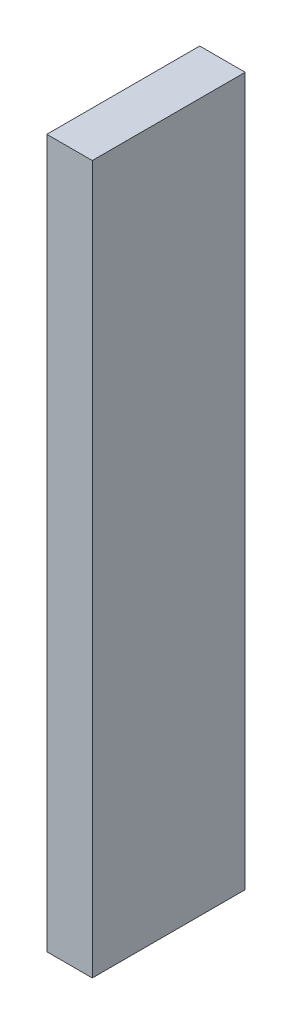
ISO-10303-21;
HEADER;
FILE_DESCRIPTION(('STEP AP214'),'2;1');
FILE_NAME('part.step','',(''),(''),'','','');
FILE_SCHEMA(('AUTOMOTIVE_DESIGN { 1 0 10303 214 1 1 1 1 }'));
ENDSEC;
DATA;
#1=APPLICATION_CONTEXT('core data for automotive mechanical design processes');
#2=APPLICATION_PROTOCOL_DEFINITION('international standard','automotive_design',2000,#1);
#3=PRODUCT_CONTEXT('',#1,'mechanical');
#4=PRODUCT('Part','Part','',(#3));
#5=PRODUCT_RELATED_PRODUCT_CATEGORY('part','',(#4));
#6=PRODUCT_DEFINITION_FORMATION('','',#4);
#7=PRODUCT_DEFINITION_CONTEXT('part definition',#1,'design');
#8=PRODUCT_DEFINITION('design','',#6,#7);
#9=PRODUCT_DEFINITION_SHAPE('','',#8);
#10=(LENGTH_UNIT() NAMED_UNIT(*) SI_UNIT(.MILLI.,.METRE.));
#11=(NAMED_UNIT(*) PLANE_ANGLE_UNIT() SI_UNIT($,.RADIAN.));
#12=(NAMED_UNIT(*) SI_UNIT($,.STERADIAN.) SOLID_ANGLE_UNIT());
#13=UNCERTAINTY_MEASURE_WITH_UNIT(LENGTH_MEASURE(1.E-05),#10,'distance_accuracy_value','');
#14=(GEOMETRIC_REPRESENTATION_CONTEXT(3) GLOBAL_UNCERTAINTY_ASSIGNED_CONTEXT((#13)) GLOBAL_UNIT_ASSIGNED_CONTEXT((#10,
#11,#12)) REPRESENTATION_CONTEXT('',''));
#15=CARTESIAN_POINT('',(0.,0.,0.));
#16=DIRECTION('',(0.,0.,1.));
#17=DIRECTION('',(1.,0.,0.));
#18=AXIS2_PLACEMENT_3D('',#15,#16,#17);
#19=CARTESIAN_POINT('',(130.275545153243,22.4180708263693,121.072024477607));
#20=DIRECTION('',(-1.69244514382854E-09,0.,1.));
#21=DIRECTION('',(1.,0.,1.69244514382854E-09));
#22=AXIS2_PLACEMENT_3D('',#19,#20,#21);
#23=PLANE('',#22);
#24=DIRECTION('',(0.,-1.,0.));
#25=VECTOR('',#24,1.);
#26=CARTESIAN_POINT('',(131.258630250256,22.4180708263693,121.07202447927));
#27=LINE('',#26,#25);
#28=CARTESIAN_POINT('',(131.258630250256,22.4180708263693,121.07202447927));
#29=VERTEX_POINT('',#28);
#30=CARTESIAN_POINT('',(131.258630250256,7.11212965552235,121.07202447927));
#31=VERTEX_POINT('',#30);
#32=EDGE_CURVE('E79',#29,#31,#27,.T.);
#33=ORIENTED_EDGE('',*,*,#32,.F.);
#34=DIRECTION('',(1.,0.,1.69244514382854E-09));
#35=VECTOR('',#34,1.);
#36=CARTESIAN_POINT('',(130.275545153243,22.4180708263693,121.072024477607));
#37=LINE('',#36,#35);
#38=CARTESIAN_POINT('',(130.275545153243,22.4180708263693,121.072024477607));
#39=VERTEX_POINT('',#38);
#40=EDGE_CURVE('E32',#39,#29,#37,.T.);
#41=ORIENTED_EDGE('',*,*,#40,.F.);
#42=DIRECTION('',(0.,-1.,0.));
#43=VECTOR('',#42,1.);
#44=CARTESIAN_POINT('',(130.275545153243,22.4180708263693,121.072024477607));
#45=LINE('',#44,#43);
#46=CARTESIAN_POINT('',(130.275545153243,7.11212965552235,121.072024477607));
#47=VERTEX_POINT('',#46);
#48=EDGE_CURVE('E71',#39,#47,#45,.T.);
#49=ORIENTED_EDGE('',*,*,#48,.T.);
#50=DIRECTION('',(1.,0.,1.69244514382854E-09));
#51=VECTOR('',#50,1.);
#52=CARTESIAN_POINT('',(130.275545153243,7.11212965552235,121.072024477607));
#53=LINE('',#52,#51);
#54=EDGE_CURVE('E10',#47,#31,#53,.T.);
#55=ORIENTED_EDGE('',*,*,#54,.T.);
#56=EDGE_LOOP('',(#33,#41,#49,#55));
#57=FACE_BOUND('',#56,.T.);
#58=ADVANCED_FACE('F16',(#57),#23,.T.);
#59=CARTESIAN_POINT('',(130.275545153243,7.11212965552235,121.072024477607));
#60=DIRECTION('',(0.,-1.,0.));
#61=DIRECTION('',(0.,0.,-1.));
#62=AXIS2_PLACEMENT_3D('',#59,#60,#61);
#63=PLANE('',#62);
#64=DIRECTION('',(1.69244514382854E-09,0.,-1.));
#65=VECTOR('',#64,1.);
#66=CARTESIAN_POINT('',(131.258630250256,7.11212965552235,121.07202447927));
#67=LINE('',#66,#65);
#68=CARTESIAN_POINT('',(131.258630255852,7.11212965552235,117.766083308422));
#69=VERTEX_POINT('',#68);
#70=EDGE_CURVE('E82',#31,#69,#67,.T.);
#71=ORIENTED_EDGE('',*,*,#70,.F.);
#72=ORIENTED_EDGE('',*,*,#54,.F.);
#73=DIRECTION('',(1.69244514382854E-09,0.,-1.));
#74=VECTOR('',#73,1.);
#75=CARTESIAN_POINT('',(130.275545153243,7.11212965552235,121.072024477607));
#76=LINE('',#75,#74);
#77=CARTESIAN_POINT('',(130.275545158838,7.11212965552235,117.766083306758));
#78=VERTEX_POINT('',#77);
#79=EDGE_CURVE('E67',#47,#78,#76,.T.);
#80=ORIENTED_EDGE('',*,*,#79,.T.);
#81=DIRECTION('',(1.,0.,1.69244514382854E-09));
#82=VECTOR('',#81,1.);
#83=CARTESIAN_POINT('',(130.275545158838,7.11212965552235,117.766083306758));
#84=LINE('',#83,#82);
#85=EDGE_CURVE('E24',#78,#69,#84,.T.);
#86=ORIENTED_EDGE('',*,*,#85,.T.);
#87=EDGE_LOOP('',(#71,#72,#80,#86));
#88=FACE_BOUND('',#87,.T.);
#89=ADVANCED_FACE('F68',(#88),#63,.T.);
#90=CARTESIAN_POINT('',(130.275545158838,7.11212965552235,117.766083306758));
#91=DIRECTION('',(1.69244514382854E-09,0.,-1.));
#92=DIRECTION('',(-1.,0.,-1.69244514382854E-09));
#93=AXIS2_PLACEMENT_3D('',#90,#91,#92);
#94=PLANE('',#93);
#95=DIRECTION('',(0.,1.,0.));
#96=VECTOR('',#95,1.);
#97=CARTESIAN_POINT('',(131.258630255852,7.11212965552235,117.766083308422));
#98=LINE('',#97,#96);
#99=CARTESIAN_POINT('',(131.258630255852,22.418070826371,117.766083299961));
#100=VERTEX_POINT('',#99);
#101=EDGE_CURVE('E65',#69,#100,#98,.T.);
#102=ORIENTED_EDGE('',*,*,#101,.F.);
#103=ORIENTED_EDGE('',*,*,#85,.F.);
#104=DIRECTION('',(0.,1.,0.));
#105=VECTOR('',#104,1.);
#106=CARTESIAN_POINT('',(130.275545158838,7.11212965552235,117.766083306758));
#107=LINE('',#106,#105);
#108=CARTESIAN_POINT('',(130.275545158838,22.418070826371,117.766083298297));
#109=VERTEX_POINT('',#108);
#110=EDGE_CURVE('E62',#78,#109,#107,.T.);
#111=ORIENTED_EDGE('',*,*,#110,.T.);
#112=DIRECTION('',(1.,0.,1.69244514382854E-09));
#113=VECTOR('',#112,1.);
#114=CARTESIAN_POINT('',(130.275545158838,22.418070826371,117.766083298297));
#115=LINE('',#114,#113);
#116=EDGE_CURVE('E48',#109,#100,#115,.T.);
#117=ORIENTED_EDGE('',*,*,#116,.T.);
#118=EDGE_LOOP('',(#102,#103,#111,#117));
#119=FACE_BOUND('',#118,.T.);
#120=ADVANCED_FACE('F60',(#119),#94,.T.);
#121=CARTESIAN_POINT('',(130.275545158838,22.418070826371,117.766083298297));
#122=DIRECTION('',(0.,1.,0.));
#123=DIRECTION('',(-1.,0.,0.));
#124=AXIS2_PLACEMENT_3D('',#121,#122,#123);
#125=PLANE('',#124);
#126=DIRECTION('',(-1.69244514382854E-09,0.,1.));
#127=VECTOR('',#126,1.);
#128=CARTESIAN_POINT('',(131.258630255852,22.418070826371,117.766083299961));
#129=LINE('',#128,#127);
#130=EDGE_CURVE('E85',#100,#29,#129,.T.);
#131=ORIENTED_EDGE('',*,*,#130,.F.);
#132=ORIENTED_EDGE('',*,*,#116,.F.);
#133=DIRECTION('',(-1.69244514382854E-09,0.,1.));
#134=VECTOR('',#133,1.);
#135=CARTESIAN_POINT('',(130.275545158838,22.418070826371,117.766083298297));
#136=LINE('',#135,#134);
#137=EDGE_CURVE('E74',#109,#39,#136,.T.);
#138=ORIENTED_EDGE('',*,*,#137,.T.);
#139=ORIENTED_EDGE('',*,*,#40,.T.);
#140=EDGE_LOOP('',(#131,#132,#138,#139));
#141=FACE_BOUND('',#140,.T.);
#142=ADVANCED_FACE('F96',(#141),#125,.T.);
#143=CARTESIAN_POINT('',(130.275545201028,17.2651002409467,92.8378607087388));
#144=DIRECTION('',(1.,0.,1.69244514382854E-09));
#145=DIRECTION('',(0.,1.,0.));
#146=AXIS2_PLACEMENT_3D('',#143,#144,#145);
#147=PLANE('',#146);
#148=ORIENTED_EDGE('',*,*,#48,.F.);
#149=ORIENTED_EDGE('',*,*,#137,.F.);
#150=ORIENTED_EDGE('',*,*,#110,.F.);
#151=ORIENTED_EDGE('',*,*,#79,.F.);
#152=EDGE_LOOP('',(#148,#149,#150,#151));
#153=FACE_BOUND('',#152,.T.);
#154=ADVANCED_FACE('F73',(#153),#147,.F.);
#155=CARTESIAN_POINT('',(131.258630298041,17.2651002409467,92.8378607104026));
#156=DIRECTION('',(1.,0.,1.69244514382854E-09));
#157=DIRECTION('',(0.,1.,0.));
#158=AXIS2_PLACEMENT_3D('',#155,#156,#157);
#159=PLANE('',#158);
#160=ORIENTED_EDGE('',*,*,#32,.T.);
#161=ORIENTED_EDGE('',*,*,#70,.T.);
#162=ORIENTED_EDGE('',*,*,#101,.T.);
#163=ORIENTED_EDGE('',*,*,#130,.T.);
#164=EDGE_LOOP('',(#160,#161,#162,#163));
#165=FACE_BOUND('',#164,.T.);
#166=ADVANCED_FACE('F89',(#165),#159,.T.);
#167=CLOSED_SHELL('',(#58,#89,#120,#142,#154,#166));
#168=MANIFOLD_SOLID_BREP('B1',#167);
#169=ADVANCED_BREP_SHAPE_REPRESENTATION('',(#18,#168),#14);
#170=SHAPE_DEFINITION_REPRESENTATION(#9,#169);
ENDSEC;
END-ISO-10303-21;
